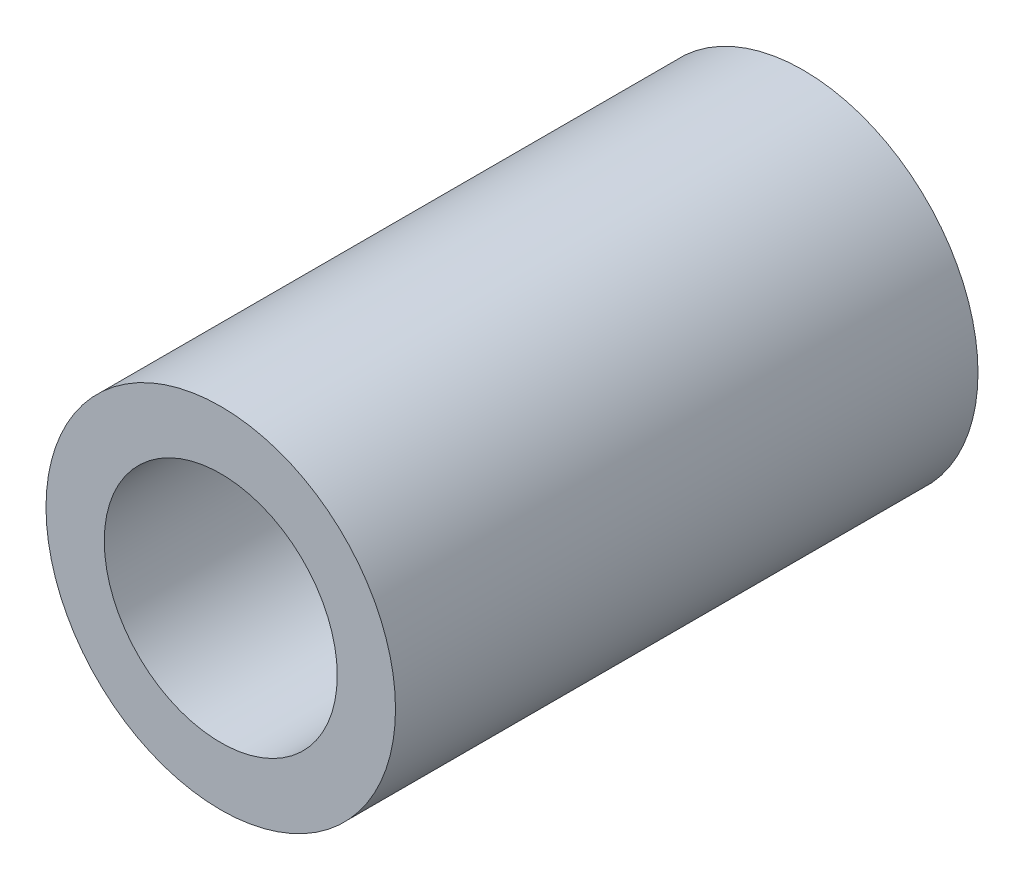
ISO-10303-21;
HEADER;
FILE_DESCRIPTION(('STEP AP214'),'2;1');
FILE_NAME('part.step','',(''),(''),'','','');
FILE_SCHEMA(('AUTOMOTIVE_DESIGN { 1 0 10303 214 1 1 1 1 }'));
ENDSEC;
DATA;
#1=APPLICATION_CONTEXT('core data for automotive mechanical design processes');
#2=APPLICATION_PROTOCOL_DEFINITION('international standard','automotive_design',2000,#1);
#3=PRODUCT_CONTEXT('',#1,'mechanical');
#4=PRODUCT('Part','Part','',(#3));
#5=PRODUCT_RELATED_PRODUCT_CATEGORY('part','',(#4));
#6=PRODUCT_DEFINITION_FORMATION('','',#4);
#7=PRODUCT_DEFINITION_CONTEXT('part definition',#1,'design');
#8=PRODUCT_DEFINITION('design','',#6,#7);
#9=PRODUCT_DEFINITION_SHAPE('','',#8);
#10=(LENGTH_UNIT() NAMED_UNIT(*) SI_UNIT(.MILLI.,.METRE.));
#11=(NAMED_UNIT(*) PLANE_ANGLE_UNIT() SI_UNIT($,.RADIAN.));
#12=(NAMED_UNIT(*) SI_UNIT($,.STERADIAN.) SOLID_ANGLE_UNIT());
#13=UNCERTAINTY_MEASURE_WITH_UNIT(LENGTH_MEASURE(1.E-05),#10,'distance_accuracy_value','');
#14=(GEOMETRIC_REPRESENTATION_CONTEXT(3) GLOBAL_UNCERTAINTY_ASSIGNED_CONTEXT((#13)) GLOBAL_UNIT_ASSIGNED_CONTEXT((#10,
#11,#12)) REPRESENTATION_CONTEXT('',''));
#15=CARTESIAN_POINT('',(0.,0.,0.));
#16=DIRECTION('',(0.,0.,1.));
#17=DIRECTION('',(1.,0.,0.));
#18=AXIS2_PLACEMENT_3D('',#15,#16,#17);
#19=CARTESIAN_POINT('',(0.,0.,10.));
#20=DIRECTION('',(0.,0.,1.));
#21=DIRECTION('',(1.,0.,0.));
#22=AXIS2_PLACEMENT_3D('',#19,#20,#21);
#23=PLANE('',#22);
#24=CARTESIAN_POINT('',(0.,0.,10.));
#25=DIRECTION('',(0.,0.,1.));
#26=DIRECTION('',(1.,0.,0.));
#27=AXIS2_PLACEMENT_3D('',#24,#25,#26);
#28=CIRCLE('',#27,3.);
#29=CARTESIAN_POINT('',(3.,0.,10.));
#30=VERTEX_POINT('',#29);
#31=EDGE_CURVE('E10',#30,#30,#28,.T.);
#32=ORIENTED_EDGE('',*,*,#31,.T.);
#33=EDGE_LOOP('',(#32));
#34=FACE_BOUND('',#33,.T.);
#35=CARTESIAN_POINT('',(0.,0.,10.));
#36=DIRECTION('',(0.,0.,1.));
#37=DIRECTION('',(1.,0.,0.));
#38=AXIS2_PLACEMENT_3D('',#35,#36,#37);
#39=CIRCLE('',#38,2.);
#40=CARTESIAN_POINT('',(2.,0.,10.));
#41=VERTEX_POINT('',#40);
#42=EDGE_CURVE('E45',#41,#41,#39,.T.);
#43=ORIENTED_EDGE('',*,*,#42,.F.);
#44=EDGE_LOOP('',(#43));
#45=FACE_BOUND('',#44,.T.);
#46=ADVANCED_FACE('F34',(#34,#45),#23,.T.);
#47=CARTESIAN_POINT('',(0.,0.,0.));
#48=DIRECTION('',(0.,0.,1.));
#49=DIRECTION('',(1.,0.,0.));
#50=AXIS2_PLACEMENT_3D('',#47,#48,#49);
#51=PLANE('',#50);
#52=CARTESIAN_POINT('',(0.,0.,0.));
#53=DIRECTION('',(0.,0.,1.));
#54=DIRECTION('',(1.,0.,0.));
#55=AXIS2_PLACEMENT_3D('',#52,#53,#54);
#56=CIRCLE('',#55,3.);
#57=CARTESIAN_POINT('',(3.,0.,0.));
#58=VERTEX_POINT('',#57);
#59=EDGE_CURVE('E41',#58,#58,#56,.T.);
#60=ORIENTED_EDGE('',*,*,#59,.F.);
#61=EDGE_LOOP('',(#60));
#62=FACE_BOUND('',#61,.T.);
#63=CARTESIAN_POINT('',(0.,0.,0.));
#64=DIRECTION('',(0.,0.,1.));
#65=DIRECTION('',(1.,0.,0.));
#66=AXIS2_PLACEMENT_3D('',#63,#64,#65);
#67=CIRCLE('',#66,2.);
#68=CARTESIAN_POINT('',(2.,0.,0.));
#69=VERTEX_POINT('',#68);
#70=EDGE_CURVE('E49',#69,#69,#67,.T.);
#71=ORIENTED_EDGE('',*,*,#70,.T.);
#72=EDGE_LOOP('',(#71));
#73=FACE_BOUND('',#72,.T.);
#74=ADVANCED_FACE('F55',(#62,#73),#51,.F.);
#75=CARTESIAN_POINT('',(0.,0.,10.));
#76=DIRECTION('',(0.,0.,-1.));
#77=DIRECTION('',(-1.,0.,0.));
#78=AXIS2_PLACEMENT_3D('',#75,#76,#77);
#79=CYLINDRICAL_SURFACE('',#78,3.);
#80=ORIENTED_EDGE('',*,*,#31,.F.);
#81=EDGE_LOOP('',(#80));
#82=FACE_BOUND('',#81,.T.);
#83=ORIENTED_EDGE('',*,*,#59,.T.);
#84=EDGE_LOOP('',(#83));
#85=FACE_BOUND('',#84,.T.);
#86=ADVANCED_FACE('F36',(#82,#85),#79,.T.);
#87=CARTESIAN_POINT('',(0.,0.,10.));
#88=DIRECTION('',(0.,0.,-1.));
#89=DIRECTION('',(-1.,0.,0.));
#90=AXIS2_PLACEMENT_3D('',#87,#88,#89);
#91=CYLINDRICAL_SURFACE('',#90,2.);
#92=ORIENTED_EDGE('',*,*,#42,.T.);
#93=EDGE_LOOP('',(#92));
#94=FACE_BOUND('',#93,.T.);
#95=ORIENTED_EDGE('',*,*,#70,.F.);
#96=EDGE_LOOP('',(#95));
#97=FACE_BOUND('',#96,.T.);
#98=ADVANCED_FACE('F57',(#94,#97),#91,.F.);
#99=CLOSED_SHELL('',(#46,#74,#86,#98));
#100=MANIFOLD_SOLID_BREP('B2',#99);
#101=ADVANCED_BREP_SHAPE_REPRESENTATION('',(#18,#100),#14);
#102=SHAPE_DEFINITION_REPRESENTATION(#9,#101);
ENDSEC;
END-ISO-10303-21;
